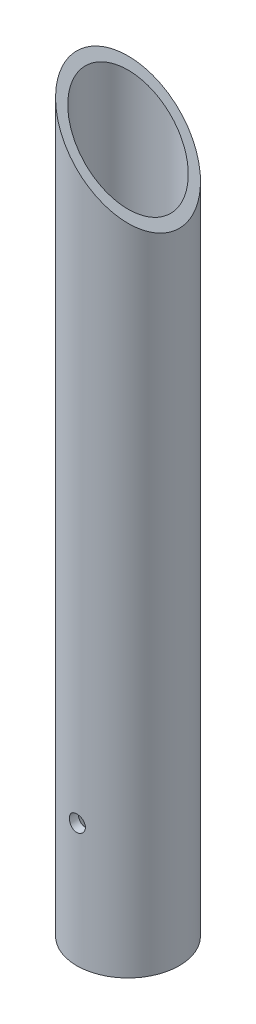
ISO-10303-21;
HEADER;
FILE_DESCRIPTION(('STEP AP214'),'2;1');
FILE_NAME('part.step','',(''),(''),'','','');
FILE_SCHEMA(('AUTOMOTIVE_DESIGN { 1 0 10303 214 1 1 1 1 }'));
ENDSEC;
DATA;
#1=APPLICATION_CONTEXT('core data for automotive mechanical design processes');
#2=APPLICATION_PROTOCOL_DEFINITION('international standard','automotive_design',2000,#1);
#3=PRODUCT_CONTEXT('',#1,'mechanical');
#4=PRODUCT('Part','Part','',(#3));
#5=PRODUCT_RELATED_PRODUCT_CATEGORY('part','',(#4));
#6=PRODUCT_DEFINITION_FORMATION('','',#4);
#7=PRODUCT_DEFINITION_CONTEXT('part definition',#1,'design');
#8=PRODUCT_DEFINITION('design','',#6,#7);
#9=PRODUCT_DEFINITION_SHAPE('','',#8);
#10=(LENGTH_UNIT() NAMED_UNIT(*) SI_UNIT(.MILLI.,.METRE.));
#11=(NAMED_UNIT(*) PLANE_ANGLE_UNIT() SI_UNIT($,.RADIAN.));
#12=(NAMED_UNIT(*) SI_UNIT($,.STERADIAN.) SOLID_ANGLE_UNIT());
#13=UNCERTAINTY_MEASURE_WITH_UNIT(LENGTH_MEASURE(1.E-05),#10,'distance_accuracy_value','');
#14=(GEOMETRIC_REPRESENTATION_CONTEXT(3) GLOBAL_UNCERTAINTY_ASSIGNED_CONTEXT((#13)) GLOBAL_UNIT_ASSIGNED_CONTEXT((#10,
#11,#12)) REPRESENTATION_CONTEXT('',''));
#15=CARTESIAN_POINT('',(0.,0.,0.));
#16=DIRECTION('',(0.,0.,1.));
#17=DIRECTION('',(1.,0.,0.));
#18=AXIS2_PLACEMENT_3D('',#15,#16,#17);
#19=CARTESIAN_POINT('',(0.,-101.6,25.2984));
#20=DIRECTION('',(0.,0.,-1.));
#21=DIRECTION('',(-1.,0.,0.));
#22=AXIS2_PLACEMENT_3D('',#19,#20,#21);
#23=CYLINDRICAL_SURFACE('',#22,3.302);
#24=CARTESIAN_POINT('',(3.302,-101.6,17.212131535635));
#25=CARTESIAN_POINT('',(3.30199130007002,-101.783512818645,17.2121357912959));
#26=CARTESIAN_POINT('',(3.28663585313906,-101.967256012137,17.2151010141485));
#27=CARTESIAN_POINT('',(3.22562147458273,-102.329703814538,17.2266354162427));
#28=CARTESIAN_POINT('',(3.17990188170017,-102.508397589212,17.235215812932));
#29=CARTESIAN_POINT('',(3.05960981849083,-102.8552358969,17.2569745758185));
#30=CARTESIAN_POINT('',(2.98507722350842,-103.023394637605,17.2701465850535));
#31=CARTESIAN_POINT('',(2.80936907233875,-103.344760680324,17.2995959096477));
#32=CARTESIAN_POINT('',(2.70820265297164,-103.497973085071,17.3158721595603));
#33=CARTESIAN_POINT('',(2.48072155818345,-103.78710779034,17.3499290051584));
#34=CARTESIAN_POINT('',(2.35413406488901,-103.9228137313,17.3677245991603));
#35=CARTESIAN_POINT('',(2.07998787720683,-104.171200837909,17.4026833164607));
#36=CARTESIAN_POINT('',(1.93242669927012,-104.283879272953,17.4198463645542));
#37=CARTESIAN_POINT('',(1.61912172583027,-104.483824177459,17.4517639888191));
#38=CARTESIAN_POINT('',(1.45324708551853,-104.570888997584,17.4664990714187));
#39=CARTESIAN_POINT('',(1.10890232271858,-104.715834785477,17.4917344998527));
#40=CARTESIAN_POINT('',(0.930433354973723,-104.773718424845,17.5022352333331));
#41=CARTESIAN_POINT('',(0.568185677153312,-104.857996883894,17.5177140797912));
#42=CARTESIAN_POINT('',(0.384493776564784,-104.884753008328,17.5227555116936));
#43=CARTESIAN_POINT('',(0.0151634313080578,-104.907142782504,17.5269660010195));
#44=CARTESIAN_POINT('',(-0.170474847849683,-104.902779057434,17.526135553779));
#45=CARTESIAN_POINT('',(-0.535948321762245,-104.863329959929,17.5187453165642));
#46=CARTESIAN_POINT('',(-0.715827218444372,-104.828633892647,17.5122581315663));
#47=CARTESIAN_POINT('',(-1.06716471944178,-104.730120368197,17.4943647240374));
#48=CARTESIAN_POINT('',(-1.23862294887289,-104.666301615798,17.4829582827243));
#49=CARTESIAN_POINT('',(-1.56938357210161,-104.510981755474,17.4563863678042));
#50=CARTESIAN_POINT('',(-1.72861081598389,-104.419324375918,17.4411997634979));
#51=CARTESIAN_POINT('',(-2.02955810161077,-104.211051521487,17.4087481619631));
#52=CARTESIAN_POINT('',(-2.1712776543047,-104.094435349673,17.3914831067029));
#53=CARTESIAN_POINT('',(-2.4354828311894,-103.837433376739,17.35647319222));
#54=CARTESIAN_POINT('',(-2.55764096472366,-103.696711167756,17.3387250336484));
#55=CARTESIAN_POINT('',(-2.77672597148959,-103.396532388428,17.3049934941075));
#56=CARTESIAN_POINT('',(-2.87364158354753,-103.237067502496,17.2890109026162));
#57=CARTESIAN_POINT('',(-3.03957910177399,-102.903449024681,17.2606131954961));
#58=CARTESIAN_POINT('',(-3.10853019051617,-102.729259474038,17.248207159813));
#59=CARTESIAN_POINT('',(-3.21595739527462,-102.371706911882,17.2285032482303));
#60=CARTESIAN_POINT('',(-3.25449780559778,-102.188364130084,17.2211945992488));
#61=CARTESIAN_POINT('',(-3.2855165099523,-101.93637451914,17.2152867144043));
#62=CARTESIAN_POINT('',(-3.29169262178811,-101.869262681312,17.2141062438161));
#63=CARTESIAN_POINT('',(-3.29993596755384,-101.734777589169,17.2125278723074));
#64=CARTESIAN_POINT('',(-3.30200319548789,-101.667404334473,17.2121299725289));
#65=CARTESIAN_POINT('',(-3.30199130007002,-101.416487181355,17.2121357912959));
#66=CARTESIAN_POINT('',(-3.28663585313906,-101.232743987863,17.2151010141485));
#67=CARTESIAN_POINT('',(-3.22562147458273,-100.870296185462,17.2266354162427));
#68=CARTESIAN_POINT('',(-3.17990188170017,-100.691602410788,17.235215812932));
#69=CARTESIAN_POINT('',(-3.05960981849083,-100.3447641031,17.2569745758185));
#70=CARTESIAN_POINT('',(-2.98507722350842,-100.176605362395,17.2701465850535));
#71=CARTESIAN_POINT('',(-2.80936907233875,-99.8552393196757,17.2995959096477));
#72=CARTESIAN_POINT('',(-2.70820265297164,-99.7020269149291,17.3158721595603));
#73=CARTESIAN_POINT('',(-2.48072155818345,-99.4128922096604,17.3499290051584));
#74=CARTESIAN_POINT('',(-2.35413406488901,-99.2771862687002,17.3677245991603));
#75=CARTESIAN_POINT('',(-2.07998787720683,-99.0287991620913,17.4026833164607));
#76=CARTESIAN_POINT('',(-1.93242669927012,-98.9161207270474,17.4198463645542));
#77=CARTESIAN_POINT('',(-1.61912172583027,-98.7161758225405,17.4517639888191));
#78=CARTESIAN_POINT('',(-1.45324708551853,-98.6291110024161,17.4664990714187));
#79=CARTESIAN_POINT('',(-1.10890232271858,-98.4841652145225,17.4917344998527));
#80=CARTESIAN_POINT('',(-0.930433354973721,-98.4262815751546,17.5022352333331));
#81=CARTESIAN_POINT('',(-0.568185677153313,-98.3420031161057,17.5177140797912));
#82=CARTESIAN_POINT('',(-0.384493776564784,-98.3152469916725,17.5227555116936));
#83=CARTESIAN_POINT('',(-0.0151634313080579,-98.2928572174964,17.5269660010195));
#84=CARTESIAN_POINT('',(0.170474847849683,-98.2972209425664,17.526135553779));
#85=CARTESIAN_POINT('',(0.535948321762243,-98.3366700400711,17.5187453165642));
#86=CARTESIAN_POINT('',(0.715827218444368,-98.3713661073525,17.5122581315663));
#87=CARTESIAN_POINT('',(1.06716471944178,-98.4698796318034,17.4943647240374));
#88=CARTESIAN_POINT('',(1.23862294887289,-98.5336983842019,17.4829582827243));
#89=CARTESIAN_POINT('',(1.56938357210161,-98.6890182445264,17.4563863678042));
#90=CARTESIAN_POINT('',(1.72861081598389,-98.7806756240815,17.4411997634979));
#91=CARTESIAN_POINT('',(2.02955810161077,-98.988948478513,17.4087481619631));
#92=CARTESIAN_POINT('',(2.1712776543047,-99.1055646503267,17.3914831067029));
#93=CARTESIAN_POINT('',(2.4354828311894,-99.3625666232612,17.35647319222));
#94=CARTESIAN_POINT('',(2.55764096472366,-99.5032888322443,17.3387250336484));
#95=CARTESIAN_POINT('',(2.77672597148959,-99.8034676115724,17.3049934941075));
#96=CARTESIAN_POINT('',(2.87364158354753,-99.9629324975044,17.2890109026162));
#97=CARTESIAN_POINT('',(3.03957910177399,-100.296550975319,17.2606131954961));
#98=CARTESIAN_POINT('',(3.10853019051618,-100.470740525962,17.248207159813));
#99=CARTESIAN_POINT('',(3.21595739527462,-100.828293088118,17.2285032482303));
#100=CARTESIAN_POINT('',(3.25449780559778,-101.011635869916,17.2211945992487));
#101=CARTESIAN_POINT('',(3.2855165099523,-101.26362548086,17.2152867144043));
#102=CARTESIAN_POINT('',(3.29169262178811,-101.330737318688,17.2141062438161));
#103=CARTESIAN_POINT('',(3.29993596755384,-101.465222410831,17.2125278723074));
#104=CARTESIAN_POINT('',(3.30200319548789,-101.532595665527,17.2121299725289));
#105=CARTESIAN_POINT('',(3.302,-101.6,17.212131535635));
#106=B_SPLINE_CURVE_WITH_KNOTS('',3,(#24,#25,#26,#27,#28,#29,#30,#31,#32,#33,#34,#35,#36,#37,
#38,#39,#40,#41,#42,#43,#44,#45,#46,#47,#48,#49,#50,#51,#52,#53,#54,#55,#56,#57,#58,#59,#60,#61,
#62,#63,#64,#65,#66,#67,#68,#69,#70,#71,#72,#73,#74,#75,#76,#77,#78,#79,#80,#81,#82,#83,#84,#85,
#86,#87,#88,#89,#90,#91,#92,#93,#94,#95,#96,#97,#98,#99,#100,#101,#102,#103,#104,#105),
.UNSPECIFIED.,.T.,.F.,(4,2,2,2,2,2,2,2,2,2,2,2,2,2,2,2,2,2,2,2,2,2,2,2,2,2,2,2,2,2,2,2,2,2,2,2,
2,2,2,2,4),(0.,0.550280728118776,1.1016641231347,1.65228715504278,2.20272153951086,
2.75941341573735,3.31617126630994,3.87720172279344,4.4381808064211,4.99258136898155,
5.5469351643474,6.0942767793971,6.64164273979224,7.19213997066774,7.74265257536888,
8.30158887354543,8.86077409849182,9.42136669374738,9.98077088361991,10.1828889285657,
10.3850072684503,10.9352879965691,11.486671391585,12.0372944234931,12.5877288079612,
13.1444206841877,13.7011785347603,14.2622089912438,14.8231880748714,15.3775886374319,
15.9319424327977,16.4792840478474,17.0266500082426,17.5771472391181,18.1276598438192,
18.6865961419958,19.2457813669421,19.8063739621977,20.3657781520702,20.567896197016,
20.7700145369006),.UNSPECIFIED.);
#107=CARTESIAN_POINT('',(3.302,-101.6,17.212131535635));
#108=VERTEX_POINT('',#107);
#109=EDGE_CURVE('E19',#108,#108,#106,.T.);
#110=ORIENTED_EDGE('',*,*,#109,.T.);
#111=EDGE_LOOP('',(#110));
#112=FACE_BOUND('',#111,.T.);
#113=CARTESIAN_POINT('',(-3.302,-101.6,20.8218039564299));
#114=CARTESIAN_POINT('',(-3.30199160753357,-101.415927011816,20.8218073806267));
#115=CARTESIAN_POINT('',(-3.28654301260894,-101.231617371956,20.8242733684239));
#116=CARTESIAN_POINT('',(-3.22514065789151,-100.868022619064,20.8338695525104));
#117=CARTESIAN_POINT('',(-3.17912451730725,-100.688748563809,20.8410092863234));
#118=CARTESIAN_POINT('',(-3.05799853788291,-100.340741796334,20.8591249107495));
#119=CARTESIAN_POINT('',(-2.9829239644666,-100.171996593407,20.870096149862));
#120=CARTESIAN_POINT('',(-2.80588978432558,-99.8495680404577,20.8946321673489));
#121=CARTESIAN_POINT('',(-2.7039404616579,-99.6958789597579,20.9081959530987));
#122=CARTESIAN_POINT('',(-2.47508070345098,-99.4064927241757,20.9365245741082));
#123=CARTESIAN_POINT('',(-2.34797939326253,-99.2709473361724,20.9512980530242));
#124=CARTESIAN_POINT('',(-2.07283012487502,-99.0230095326334,20.9803050551998));
#125=CARTESIAN_POINT('',(-1.92477991142582,-98.9106196130989,20.9945385201148));
#126=CARTESIAN_POINT('',(-1.6109795917043,-98.7116369694203,21.0209503025573));
#127=CARTESIAN_POINT('',(-1.44514095474079,-98.6251822552555,21.0331174809926));
#128=CARTESIAN_POINT('',(-1.10107506605374,-98.4814114743445,21.05393135813));
#129=CARTESIAN_POINT('',(-0.922848635277752,-98.4240934787771,21.0625782898611));
#130=CARTESIAN_POINT('',(-0.560609603386695,-98.3406777001467,21.0753173636847));
#131=CARTESIAN_POINT('',(-0.376656148144354,-98.3143287558805,21.0794461292818));
#132=CARTESIAN_POINT('',(-0.00689553053005387,-98.2928187423374,21.0828093145542));
#133=CARTESIAN_POINT('',(0.178911522424525,-98.2976558429065,21.0820440214374));
#134=CARTESIAN_POINT('',(0.545387987681637,-98.3381832224789,21.07573448412));
#135=CARTESIAN_POINT('',(0.726088139323015,-98.3736029879841,21.0702321418829));
#136=CARTESIAN_POINT('',(1.07894959112666,-98.4738656431935,21.0551133735714));
#137=CARTESIAN_POINT('',(1.25111058419742,-98.5387095902219,21.0454967996575));
#138=CARTESIAN_POINT('',(1.58282366581658,-98.6962561888344,21.0231579611584));
#139=CARTESIAN_POINT('',(1.74232079287567,-98.7890726938112,21.0104230448454));
#140=CARTESIAN_POINT('',(2.04356567709641,-98.9998387247241,20.983266477008));
#141=CARTESIAN_POINT('',(2.18531354855578,-99.1177880888019,20.9688448363465));
#142=CARTESIAN_POINT('',(2.44862169860154,-99.3769527385603,20.9397407137842));
#143=CARTESIAN_POINT('',(2.56995357233259,-99.5184000368347,20.925057084518));
#144=CARTESIAN_POINT('',(2.78725086621637,-99.8198417364553,20.8972247356282));
#145=CARTESIAN_POINT('',(2.8832048216977,-99.9798444735734,20.8840767112186));
#146=CARTESIAN_POINT('',(3.04705056434819,-100.314146711663,20.8608028211873));
#147=CARTESIAN_POINT('',(3.11489418988142,-100.48847014126,20.8506821505325));
#148=CARTESIAN_POINT('',(3.22013679209878,-100.846000745735,20.8346903229562));
#149=CARTESIAN_POINT('',(3.25760012468806,-101.029188265883,20.828810186069));
#150=CARTESIAN_POINT('',(3.28690487349376,-101.278069948559,20.8241928990953));
#151=CARTESIAN_POINT('',(3.29256105712587,-101.342314281715,20.8232989883506));
#152=CARTESIAN_POINT('',(3.30011009230049,-101.471029390881,20.8221039168489));
#153=CARTESIAN_POINT('',(3.30200294075023,-101.535500167079,20.8218027565791));
#154=CARTESIAN_POINT('',(3.30199160753357,-101.784072988184,20.8218073806267));
#155=CARTESIAN_POINT('',(3.28654301260894,-101.968382628044,20.8242733684239));
#156=CARTESIAN_POINT('',(3.22514065789151,-102.331977380936,20.8338695525104));
#157=CARTESIAN_POINT('',(3.17912451730725,-102.511251436191,20.8410092863234));
#158=CARTESIAN_POINT('',(3.05799853788291,-102.859258203666,20.8591249107495));
#159=CARTESIAN_POINT('',(2.9829239644666,-103.028003406593,20.870096149862));
#160=CARTESIAN_POINT('',(2.80588978432558,-103.350431959542,20.8946321673489));
#161=CARTESIAN_POINT('',(2.7039404616579,-103.504121040242,20.9081959530987));
#162=CARTESIAN_POINT('',(2.47508070345098,-103.793507275824,20.9365245741082));
#163=CARTESIAN_POINT('',(2.34797939326253,-103.929052663828,20.9512980530242));
#164=CARTESIAN_POINT('',(2.07283012487502,-104.176990467367,20.9803050551998));
#165=CARTESIAN_POINT('',(1.92477991142582,-104.289380386901,20.9945385201148));
#166=CARTESIAN_POINT('',(1.6109795917043,-104.48836303058,21.0209503025573));
#167=CARTESIAN_POINT('',(1.44514095474079,-104.574817744745,21.0331174809926));
#168=CARTESIAN_POINT('',(1.10107506605374,-104.718588525656,21.05393135813));
#169=CARTESIAN_POINT('',(0.922848635277752,-104.775906521223,21.0625782898611));
#170=CARTESIAN_POINT('',(0.560609603386695,-104.859322299853,21.0753173636847));
#171=CARTESIAN_POINT('',(0.376656148144354,-104.885671244119,21.0794461292818));
#172=CARTESIAN_POINT('',(0.00689553053005382,-104.907181257663,21.0828093145542));
#173=CARTESIAN_POINT('',(-0.178911522424526,-104.902344157093,21.0820440214374));
#174=CARTESIAN_POINT('',(-0.545387987681637,-104.861816777521,21.07573448412));
#175=CARTESIAN_POINT('',(-0.726088139323015,-104.826397012016,21.0702321418829));
#176=CARTESIAN_POINT('',(-1.07894959112666,-104.726134356806,21.0551133735714));
#177=CARTESIAN_POINT('',(-1.25111058419742,-104.661290409778,21.0454967996575));
#178=CARTESIAN_POINT('',(-1.58282366581658,-104.503743811166,21.0231579611584));
#179=CARTESIAN_POINT('',(-1.74232079287567,-104.410927306189,21.0104230448454));
#180=CARTESIAN_POINT('',(-2.04356567709641,-104.200161275276,20.983266477008));
#181=CARTESIAN_POINT('',(-2.18531354855578,-104.082211911198,20.9688448363465));
#182=CARTESIAN_POINT('',(-2.44862169860154,-103.82304726144,20.9397407137842));
#183=CARTESIAN_POINT('',(-2.56995357233259,-103.681599963165,20.925057084518));
#184=CARTESIAN_POINT('',(-2.78725086621637,-103.380158263545,20.8972247356282));
#185=CARTESIAN_POINT('',(-2.88320482169769,-103.220155526427,20.8840767112186));
#186=CARTESIAN_POINT('',(-3.04705056434819,-102.885853288337,20.8608028211873));
#187=CARTESIAN_POINT('',(-3.11489418988142,-102.71152985874,20.8506821505325));
#188=CARTESIAN_POINT('',(-3.22013679209878,-102.353999254265,20.8346903229562));
#189=CARTESIAN_POINT('',(-3.25760012468806,-102.170811734116,20.828810186069));
#190=CARTESIAN_POINT('',(-3.28690487349376,-101.921930051441,20.8241928990953));
#191=CARTESIAN_POINT('',(-3.29256105712587,-101.857685718285,20.8232989883506));
#192=CARTESIAN_POINT('',(-3.30011009230049,-101.728970609118,20.822103916849));
#193=CARTESIAN_POINT('',(-3.30200294075023,-101.664499832921,20.8218027565791));
#194=CARTESIAN_POINT('',(-3.302,-101.6,20.8218039564299));
#195=B_SPLINE_CURVE_WITH_KNOTS('',3,(#113,#114,#115,#116,#117,#118,#119,#120,#121,#122,#123,
#124,#125,#126,#127,#128,#129,#130,#131,#132,#133,#134,#135,#136,#137,#138,#139,#140,#141,#142,
#143,#144,#145,#146,#147,#148,#149,#150,#151,#152,#153,#154,#155,#156,#157,#158,#159,#160,#161,
#162,#163,#164,#165,#166,#167,#168,#169,#170,#171,#172,#173,#174,#175,#176,#177,#178,#179,#180,
#181,#182,#183,#184,#185,#186,#187,#188,#189,#190,#191,#192,#193,#194),.UNSPECIFIED.,.T.,.F.,(4,
2,2,2,2,2,2,2,2,2,2,2,2,2,2,2,2,2,2,2,2,2,2,2,2,2,2,2,2,2,2,2,2,2,2,2,2,2,2,2,4),(0.,
0.55197278689678,1.10507548841285,1.65750903647682,2.20973149302041,2.76631755972952,
3.32296359125632,3.88252122115703,4.44204180408307,4.99699261923523,5.5519108673788,
6.10197039090308,6.652049681752,7.20439884684058,7.75674445485043,8.31490894049801,
8.87332515223377,9.43269418546172,9.99087516451011,10.1842882427925,10.3777014800249,
10.9296742669216,11.4827769684377,12.0352105165017,12.5874329730453,13.1440190397544,
13.7006650712812,14.2602227011819,14.8197432841079,15.3746940992601,15.9296123474037,
16.4796718709279,17.0297511617769,17.5821003268654,18.1344459348753,18.6926104205229,
19.2510266322586,19.8103956654866,20.368576644535,20.5619897228173,20.7554029600497),.UNSPECIFIED.);
#196=CARTESIAN_POINT('',(-3.302,-101.6,20.8218039564299));
#197=VERTEX_POINT('',#196);
#198=EDGE_CURVE('E46',#197,#197,#195,.T.);
#199=ORIENTED_EDGE('',*,*,#198,.F.);
#200=EDGE_LOOP('',(#199));
#201=FACE_BOUND('',#200,.T.);
#202=ADVANCED_FACE('F15',(#112,#201),#23,.F.);
#203=CARTESIAN_POINT('',(0.,-152.4,0.));
#204=DIRECTION('',(0.,1.,0.));
#205=DIRECTION('',(0.,0.,1.));
#206=AXIS2_PLACEMENT_3D('',#203,#204,#205);
#207=CYLINDRICAL_SURFACE('',#206,17.526);
#208=CARTESIAN_POINT('',(0.,-152.4,0.));
#209=DIRECTION('',(0.,1.,0.));
#210=DIRECTION('',(0.,0.,1.));
#211=AXIS2_PLACEMENT_3D('',#208,#209,#210);
#212=CIRCLE('',#211,17.526);
#213=CARTESIAN_POINT('',(0.,-152.4,17.526));
#214=VERTEX_POINT('',#213);
#215=EDGE_CURVE('E52',#214,#214,#212,.F.);
#216=ORIENTED_EDGE('',*,*,#215,.T.);
#217=EDGE_LOOP('',(#216));
#218=FACE_BOUND('',#217,.T.);
#219=CARTESIAN_POINT('',(-3.302,-101.6,-17.212131535635));
#220=CARTESIAN_POINT('',(-3.30199130007002,-101.416487181355,-17.2121357912959));
#221=CARTESIAN_POINT('',(-3.28663585313906,-101.232743987863,-17.2151010141485));
#222=CARTESIAN_POINT('',(-3.22562147458273,-100.870296185462,-17.2266354162427));
#223=CARTESIAN_POINT('',(-3.17990188170017,-100.691602410788,-17.235215812932));
#224=CARTESIAN_POINT('',(-3.05960981849083,-100.3447641031,-17.2569745758185));
#225=CARTESIAN_POINT('',(-2.98507722350842,-100.176605362395,-17.2701465850535));
#226=CARTESIAN_POINT('',(-2.80936907233875,-99.8552393196757,-17.2995959096477));
#227=CARTESIAN_POINT('',(-2.70820265297164,-99.7020269149291,-17.3158721595603));
#228=CARTESIAN_POINT('',(-2.48072155818345,-99.4128922096604,-17.3499290051584));
#229=CARTESIAN_POINT('',(-2.35413406488901,-99.2771862687002,-17.3677245991603));
#230=CARTESIAN_POINT('',(-2.07998787720683,-99.0287991620913,-17.4026833164607));
#231=CARTESIAN_POINT('',(-1.93242669927012,-98.9161207270474,-17.4198463645542));
#232=CARTESIAN_POINT('',(-1.61912172583027,-98.7161758225405,-17.4517639888191));
#233=CARTESIAN_POINT('',(-1.45324708551853,-98.6291110024161,-17.4664990714187));
#234=CARTESIAN_POINT('',(-1.10890232271858,-98.4841652145225,-17.4917344998527));
#235=CARTESIAN_POINT('',(-0.930433354973723,-98.4262815751546,-17.5022352333331));
#236=CARTESIAN_POINT('',(-0.568185677153312,-98.3420031161057,-17.5177140797912));
#237=CARTESIAN_POINT('',(-0.384493776564784,-98.3152469916725,-17.5227555116936));
#238=CARTESIAN_POINT('',(-0.0151634313080578,-98.2928572174964,-17.5269660010195));
#239=CARTESIAN_POINT('',(0.170474847849683,-98.2972209425664,-17.526135553779));
#240=CARTESIAN_POINT('',(0.535948321762245,-98.3366700400711,-17.5187453165642));
#241=CARTESIAN_POINT('',(0.715827218444372,-98.3713661073525,-17.5122581315663));
#242=CARTESIAN_POINT('',(1.06716471944178,-98.4698796318034,-17.4943647240374));
#243=CARTESIAN_POINT('',(1.23862294887289,-98.5336983842019,-17.4829582827243));
#244=CARTESIAN_POINT('',(1.56938357210161,-98.6890182445264,-17.4563863678042));
#245=CARTESIAN_POINT('',(1.72861081598389,-98.7806756240815,-17.4411997634979));
#246=CARTESIAN_POINT('',(2.02955810161077,-98.988948478513,-17.4087481619631));
#247=CARTESIAN_POINT('',(2.1712776543047,-99.1055646503267,-17.3914831067029));
#248=CARTESIAN_POINT('',(2.4354828311894,-99.3625666232612,-17.35647319222));
#249=CARTESIAN_POINT('',(2.55764096472366,-99.5032888322443,-17.3387250336484));
#250=CARTESIAN_POINT('',(2.77672597148959,-99.8034676115724,-17.3049934941075));
#251=CARTESIAN_POINT('',(2.87364158354753,-99.9629324975044,-17.2890109026162));
#252=CARTESIAN_POINT('',(3.03957910177399,-100.296550975319,-17.2606131954961));
#253=CARTESIAN_POINT('',(3.10853019051618,-100.470740525962,-17.248207159813));
#254=CARTESIAN_POINT('',(3.21595739527462,-100.828293088118,-17.2285032482303));
#255=CARTESIAN_POINT('',(3.25449780559778,-101.011635869916,-17.2211945992487));
#256=CARTESIAN_POINT('',(3.2855165099523,-101.26362548086,-17.2152867144043));
#257=CARTESIAN_POINT('',(3.29169262178811,-101.330737318688,-17.2141062438161));
#258=CARTESIAN_POINT('',(3.29993596755384,-101.465222410831,-17.2125278723074));
#259=CARTESIAN_POINT('',(3.30200319548789,-101.532595665527,-17.2121299725289));
#260=CARTESIAN_POINT('',(3.30199130007002,-101.783512818645,-17.2121357912959));
#261=CARTESIAN_POINT('',(3.28663585313906,-101.967256012137,-17.2151010141485));
#262=CARTESIAN_POINT('',(3.22562147458273,-102.329703814538,-17.2266354162427));
#263=CARTESIAN_POINT('',(3.17990188170017,-102.508397589212,-17.235215812932));
#264=CARTESIAN_POINT('',(3.05960981849083,-102.8552358969,-17.2569745758185));
#265=CARTESIAN_POINT('',(2.98507722350842,-103.023394637605,-17.2701465850535));
#266=CARTESIAN_POINT('',(2.80936907233875,-103.344760680324,-17.2995959096476));
#267=CARTESIAN_POINT('',(2.70820265297164,-103.497973085071,-17.3158721595603));
#268=CARTESIAN_POINT('',(2.48072155818345,-103.78710779034,-17.3499290051584));
#269=CARTESIAN_POINT('',(2.35413406488901,-103.9228137313,-17.3677245991603));
#270=CARTESIAN_POINT('',(2.07998787720683,-104.171200837909,-17.4026833164607));
#271=CARTESIAN_POINT('',(1.93242669927012,-104.283879272953,-17.4198463645542));
#272=CARTESIAN_POINT('',(1.61912172583027,-104.483824177459,-17.4517639888191));
#273=CARTESIAN_POINT('',(1.45324708551853,-104.570888997584,-17.4664990714187));
#274=CARTESIAN_POINT('',(1.10890232271858,-104.715834785477,-17.4917344998527));
#275=CARTESIAN_POINT('',(0.930433354973723,-104.773718424845,-17.5022352333331));
#276=CARTESIAN_POINT('',(0.568185677153312,-104.857996883894,-17.5177140797912));
#277=CARTESIAN_POINT('',(0.384493776564784,-104.884753008328,-17.5227555116936));
#278=CARTESIAN_POINT('',(0.015163431308058,-104.907142782504,-17.5269660010195));
#279=CARTESIAN_POINT('',(-0.170474847849683,-104.902779057434,-17.526135553779));
#280=CARTESIAN_POINT('',(-0.535948321762246,-104.863329959929,-17.5187453165642));
#281=CARTESIAN_POINT('',(-0.715827218444373,-104.828633892647,-17.5122581315663));
#282=CARTESIAN_POINT('',(-1.06716471944178,-104.730120368197,-17.4943647240374));
#283=CARTESIAN_POINT('',(-1.23862294887289,-104.666301615798,-17.4829582827243));
#284=CARTESIAN_POINT('',(-1.56938357210161,-104.510981755474,-17.4563863678042));
#285=CARTESIAN_POINT('',(-1.72861081598389,-104.419324375918,-17.4411997634979));
#286=CARTESIAN_POINT('',(-2.02955810161077,-104.211051521487,-17.4087481619631));
#287=CARTESIAN_POINT('',(-2.1712776543047,-104.094435349673,-17.3914831067029));
#288=CARTESIAN_POINT('',(-2.4354828311894,-103.837433376739,-17.35647319222));
#289=CARTESIAN_POINT('',(-2.55764096472366,-103.696711167756,-17.3387250336484));
#290=CARTESIAN_POINT('',(-2.77672597148959,-103.396532388428,-17.3049934941075));
#291=CARTESIAN_POINT('',(-2.87364158354753,-103.237067502496,-17.2890109026162));
#292=CARTESIAN_POINT('',(-3.03957910177399,-102.903449024681,-17.2606131954961));
#293=CARTESIAN_POINT('',(-3.10853019051617,-102.729259474038,-17.248207159813));
#294=CARTESIAN_POINT('',(-3.21595739527462,-102.371706911882,-17.2285032482303));
#295=CARTESIAN_POINT('',(-3.25449780559778,-102.188364130084,-17.2211945992487));
#296=CARTESIAN_POINT('',(-3.2855165099523,-101.93637451914,-17.2152867144043));
#297=CARTESIAN_POINT('',(-3.29169262178811,-101.869262681312,-17.2141062438161));
#298=CARTESIAN_POINT('',(-3.29993596755384,-101.734777589169,-17.2125278723074));
#299=CARTESIAN_POINT('',(-3.30200319548789,-101.667404334473,-17.2121299725289));
#300=CARTESIAN_POINT('',(-3.302,-101.6,-17.212131535635));
#301=B_SPLINE_CURVE_WITH_KNOTS('',3,(#219,#220,#221,#222,#223,#224,#225,#226,#227,#228,#229,
#230,#231,#232,#233,#234,#235,#236,#237,#238,#239,#240,#241,#242,#243,#244,#245,#246,#247,#248,
#249,#250,#251,#252,#253,#254,#255,#256,#257,#258,#259,#260,#261,#262,#263,#264,#265,#266,#267,
#268,#269,#270,#271,#272,#273,#274,#275,#276,#277,#278,#279,#280,#281,#282,#283,#284,#285,#286,
#287,#288,#289,#290,#291,#292,#293,#294,#295,#296,#297,#298,#299,#300),.UNSPECIFIED.,.T.,.F.,(4,
2,2,2,2,2,2,2,2,2,2,2,2,2,2,2,2,2,2,2,2,2,2,2,2,2,2,2,2,2,2,2,2,2,2,2,2,2,2,2,4),(0.,
0.550280728118776,1.1016641231347,1.65228715504278,2.20272153951086,2.75941341573735,
3.31617126630994,3.87720172279344,4.4381808064211,4.99258136898155,5.5469351643474,
6.0942767793971,6.64164273979224,7.19213997066774,7.74265257536888,8.30158887354543,
8.86077409849182,9.42136669374739,9.98077088361991,10.1828889285657,10.3850072684503,
10.9352879965691,11.486671391585,12.0372944234931,12.5877288079612,13.1444206841877,
13.7011785347603,14.2622089912438,14.8231880748714,15.3775886374319,15.9319424327977,
16.4792840478474,17.0266500082426,17.5771472391181,18.1276598438192,18.6865961419958,
19.2457813669421,19.8063739621977,20.3657781520702,20.567896197016,20.7700145369006),.UNSPECIFIED.);
#302=CARTESIAN_POINT('',(-3.302,-101.6,-17.212131535635));
#303=VERTEX_POINT('',#302);
#304=EDGE_CURVE('E76',#303,#303,#301,.T.);
#305=ORIENTED_EDGE('',*,*,#304,.T.);
#306=EDGE_LOOP('',(#305));
#307=FACE_BOUND('',#306,.T.);
#308=CARTESIAN_POINT('',(0.,131.318,0.));
#309=DIRECTION('',(-0.707106781186548,-0.707106781186548,0.));
#310=DIRECTION('',(-0.707106781186548,0.707106781186548,0.));
#311=AXIS2_PLACEMENT_3D('',#308,#309,#310);
#312=ELLIPSE('',#311,24.7855068941509,17.526);
#313=CARTESIAN_POINT('',(-17.526,148.844,0.));
#314=VERTEX_POINT('',#313);
#315=EDGE_CURVE('E51',#314,#314,#312,.F.);
#316=ORIENTED_EDGE('',*,*,#315,.T.);
#317=EDGE_LOOP('',(#316));
#318=FACE_BOUND('',#317,.T.);
#319=ORIENTED_EDGE('',*,*,#109,.F.);
#320=EDGE_LOOP('',(#319));
#321=FACE_BOUND('',#320,.T.);
#322=ADVANCED_FACE('F62',(#218,#307,#318,#321),#207,.F.);
#323=CARTESIAN_POINT('',(0.,-152.4,0.));
#324=DIRECTION('',(0.,1.,0.));
#325=DIRECTION('',(0.,0.,1.));
#326=AXIS2_PLACEMENT_3D('',#323,#324,#325);
#327=PLANE('',#326);
#328=ORIENTED_EDGE('',*,*,#215,.F.);
#329=EDGE_LOOP('',(#328));
#330=FACE_BOUND('',#329,.T.);
#331=CARTESIAN_POINT('',(0.,-152.4,0.));
#332=DIRECTION('',(0.,1.,0.));
#333=DIRECTION('',(0.,0.,1.));
#334=AXIS2_PLACEMENT_3D('',#331,#332,#333);
#335=CIRCLE('',#334,21.082);
#336=CARTESIAN_POINT('',(0.,-152.4,21.082));
#337=VERTEX_POINT('',#336);
#338=EDGE_CURVE('E30',#337,#337,#335,.T.);
#339=ORIENTED_EDGE('',*,*,#338,.F.);
#340=EDGE_LOOP('',(#339));
#341=FACE_BOUND('',#340,.T.);
#342=ADVANCED_FACE('F64',(#330,#341),#327,.F.);
#343=CARTESIAN_POINT('',(-21.082,152.4,-25.2984));
#344=DIRECTION('',(-0.707106781186548,-0.707106781186548,0.));
#345=DIRECTION('',(0.707106781186548,-0.707106781186548,0.));
#346=AXIS2_PLACEMENT_3D('',#343,#344,#345);
#347=PLANE('',#346);
#348=ORIENTED_EDGE('',*,*,#315,.F.);
#349=EDGE_LOOP('',(#348));
#350=FACE_BOUND('',#349,.T.);
#351=CARTESIAN_POINT('',(0.,131.318,0.));
#352=DIRECTION('',(-0.707106781186548,-0.707106781186548,0.));
#353=DIRECTION('',(-0.707106781186548,0.707106781186548,0.));
#354=AXIS2_PLACEMENT_3D('',#351,#352,#353);
#355=ELLIPSE('',#354,29.8144503219496,21.082);
#356=CARTESIAN_POINT('',(-21.082,152.4,0.));
#357=VERTEX_POINT('',#356);
#358=EDGE_CURVE('E25',#357,#357,#355,.T.);
#359=ORIENTED_EDGE('',*,*,#358,.F.);
#360=EDGE_LOOP('',(#359));
#361=FACE_BOUND('',#360,.T.);
#362=ADVANCED_FACE('F70',(#350,#361),#347,.F.);
#363=CARTESIAN_POINT('',(0.,-101.6,25.2984));
#364=DIRECTION('',(0.,0.,-1.));
#365=DIRECTION('',(-1.,0.,0.));
#366=AXIS2_PLACEMENT_3D('',#363,#364,#365);
#367=CYLINDRICAL_SURFACE('',#366,3.302);
#368=ORIENTED_EDGE('',*,*,#304,.F.);
#369=EDGE_LOOP('',(#368));
#370=FACE_BOUND('',#369,.T.);
#371=CARTESIAN_POINT('',(-3.302,-101.6,-20.8218039564299));
#372=CARTESIAN_POINT('',(-3.30199160753357,-101.784072988184,-20.8218073806267));
#373=CARTESIAN_POINT('',(-3.28654301260894,-101.968382628044,-20.8242733684239));
#374=CARTESIAN_POINT('',(-3.22514065789151,-102.331977380936,-20.8338695525104));
#375=CARTESIAN_POINT('',(-3.17912451730725,-102.511251436191,-20.8410092863234));
#376=CARTESIAN_POINT('',(-3.05799853788291,-102.859258203666,-20.8591249107495));
#377=CARTESIAN_POINT('',(-2.9829239644666,-103.028003406593,-20.870096149862));
#378=CARTESIAN_POINT('',(-2.80588978432558,-103.350431959542,-20.8946321673489));
#379=CARTESIAN_POINT('',(-2.7039404616579,-103.504121040242,-20.9081959530987));
#380=CARTESIAN_POINT('',(-2.47508070345098,-103.793507275824,-20.9365245741082));
#381=CARTESIAN_POINT('',(-2.34797939326253,-103.929052663828,-20.9512980530242));
#382=CARTESIAN_POINT('',(-2.07283012487502,-104.176990467367,-20.9803050551998));
#383=CARTESIAN_POINT('',(-1.92477991142582,-104.289380386901,-20.9945385201148));
#384=CARTESIAN_POINT('',(-1.6109795917043,-104.48836303058,-21.0209503025573));
#385=CARTESIAN_POINT('',(-1.44514095474079,-104.574817744745,-21.0331174809926));
#386=CARTESIAN_POINT('',(-1.10107506605374,-104.718588525656,-21.05393135813));
#387=CARTESIAN_POINT('',(-0.922848635277752,-104.775906521223,-21.0625782898611));
#388=CARTESIAN_POINT('',(-0.560609603386695,-104.859322299853,-21.0753173636847));
#389=CARTESIAN_POINT('',(-0.376656148144354,-104.885671244119,-21.0794461292818));
#390=CARTESIAN_POINT('',(-0.00689553053005387,-104.907181257663,-21.0828093145542));
#391=CARTESIAN_POINT('',(0.178911522424525,-104.902344157093,-21.0820440214374));
#392=CARTESIAN_POINT('',(0.545387987681637,-104.861816777521,-21.07573448412));
#393=CARTESIAN_POINT('',(0.726088139323015,-104.826397012016,-21.0702321418829));
#394=CARTESIAN_POINT('',(1.07894959112666,-104.726134356806,-21.0551133735714));
#395=CARTESIAN_POINT('',(1.25111058419742,-104.661290409778,-21.0454967996575));
#396=CARTESIAN_POINT('',(1.58282366581658,-104.503743811166,-21.0231579611584));
#397=CARTESIAN_POINT('',(1.74232079287567,-104.410927306189,-21.0104230448454));
#398=CARTESIAN_POINT('',(2.04356567709641,-104.200161275276,-20.983266477008));
#399=CARTESIAN_POINT('',(2.18531354855578,-104.082211911198,-20.9688448363465));
#400=CARTESIAN_POINT('',(2.44862169860154,-103.82304726144,-20.9397407137842));
#401=CARTESIAN_POINT('',(2.56995357233259,-103.681599963165,-20.925057084518));
#402=CARTESIAN_POINT('',(2.78725086621637,-103.380158263545,-20.8972247356282));
#403=CARTESIAN_POINT('',(2.8832048216977,-103.220155526427,-20.8840767112186));
#404=CARTESIAN_POINT('',(3.04705056434819,-102.885853288337,-20.8608028211873));
#405=CARTESIAN_POINT('',(3.11489418988142,-102.71152985874,-20.8506821505325));
#406=CARTESIAN_POINT('',(3.22013679209878,-102.353999254265,-20.8346903229562));
#407=CARTESIAN_POINT('',(3.25760012468806,-102.170811734116,-20.828810186069));
#408=CARTESIAN_POINT('',(3.28690487349376,-101.921930051441,-20.8241928990953));
#409=CARTESIAN_POINT('',(3.29256105712587,-101.857685718285,-20.8232989883506));
#410=CARTESIAN_POINT('',(3.30011009230049,-101.728970609118,-20.8221039168489));
#411=CARTESIAN_POINT('',(3.30200294075023,-101.664499832921,-20.8218027565791));
#412=CARTESIAN_POINT('',(3.30199160753357,-101.415927011816,-20.8218073806267));
#413=CARTESIAN_POINT('',(3.28654301260894,-101.231617371956,-20.8242733684239));
#414=CARTESIAN_POINT('',(3.22514065789151,-100.868022619064,-20.8338695525104));
#415=CARTESIAN_POINT('',(3.17912451730725,-100.688748563809,-20.8410092863234));
#416=CARTESIAN_POINT('',(3.05799853788291,-100.340741796334,-20.8591249107495));
#417=CARTESIAN_POINT('',(2.9829239644666,-100.171996593407,-20.870096149862));
#418=CARTESIAN_POINT('',(2.80588978432558,-99.8495680404577,-20.8946321673489));
#419=CARTESIAN_POINT('',(2.7039404616579,-99.6958789597579,-20.9081959530987));
#420=CARTESIAN_POINT('',(2.47508070345098,-99.4064927241757,-20.9365245741082));
#421=CARTESIAN_POINT('',(2.34797939326253,-99.2709473361724,-20.9512980530242));
#422=CARTESIAN_POINT('',(2.07283012487502,-99.0230095326334,-20.9803050551998));
#423=CARTESIAN_POINT('',(1.92477991142582,-98.9106196130989,-20.9945385201148));
#424=CARTESIAN_POINT('',(1.6109795917043,-98.7116369694203,-21.0209503025573));
#425=CARTESIAN_POINT('',(1.44514095474079,-98.6251822552555,-21.0331174809926));
#426=CARTESIAN_POINT('',(1.10107506605374,-98.4814114743445,-21.05393135813));
#427=CARTESIAN_POINT('',(0.922848635277752,-98.4240934787771,-21.0625782898611));
#428=CARTESIAN_POINT('',(0.560609603386695,-98.3406777001467,-21.0753173636847));
#429=CARTESIAN_POINT('',(0.376656148144354,-98.3143287558805,-21.0794461292818));
#430=CARTESIAN_POINT('',(0.00689553053005384,-98.2928187423374,-21.0828093145542));
#431=CARTESIAN_POINT('',(-0.178911522424525,-98.2976558429065,-21.0820440214374));
#432=CARTESIAN_POINT('',(-0.545387987681638,-98.3381832224789,-21.07573448412));
#433=CARTESIAN_POINT('',(-0.726088139323017,-98.3736029879841,-21.0702321418829));
#434=CARTESIAN_POINT('',(-1.07894959112667,-98.4738656431935,-21.0551133735714));
#435=CARTESIAN_POINT('',(-1.25111058419742,-98.5387095902219,-21.0454967996575));
#436=CARTESIAN_POINT('',(-1.58282366581658,-98.6962561888344,-21.0231579611584));
#437=CARTESIAN_POINT('',(-1.74232079287567,-98.7890726938112,-21.0104230448454));
#438=CARTESIAN_POINT('',(-2.04356567709641,-98.9998387247241,-20.983266477008));
#439=CARTESIAN_POINT('',(-2.18531354855578,-99.1177880888019,-20.9688448363465));
#440=CARTESIAN_POINT('',(-2.44862169860154,-99.3769527385603,-20.9397407137842));
#441=CARTESIAN_POINT('',(-2.5699535723326,-99.5184000368347,-20.925057084518));
#442=CARTESIAN_POINT('',(-2.78725086621637,-99.8198417364553,-20.8972247356282));
#443=CARTESIAN_POINT('',(-2.8832048216977,-99.9798444735734,-20.8840767112186));
#444=CARTESIAN_POINT('',(-3.04705056434819,-100.314146711663,-20.8608028211873));
#445=CARTESIAN_POINT('',(-3.11489418988142,-100.48847014126,-20.8506821505325));
#446=CARTESIAN_POINT('',(-3.22013679209878,-100.846000745735,-20.8346903229562));
#447=CARTESIAN_POINT('',(-3.25760012468806,-101.029188265883,-20.828810186069));
#448=CARTESIAN_POINT('',(-3.28690487349376,-101.278069948559,-20.8241928990953));
#449=CARTESIAN_POINT('',(-3.29256105712587,-101.342314281715,-20.8232989883506));
#450=CARTESIAN_POINT('',(-3.30011009230049,-101.471029390881,-20.822103916849));
#451=CARTESIAN_POINT('',(-3.30200294075023,-101.535500167079,-20.8218027565791));
#452=CARTESIAN_POINT('',(-3.302,-101.6,-20.8218039564299));
#453=B_SPLINE_CURVE_WITH_KNOTS('',3,(#371,#372,#373,#374,#375,#376,#377,#378,#379,#380,#381,
#382,#383,#384,#385,#386,#387,#388,#389,#390,#391,#392,#393,#394,#395,#396,#397,#398,#399,#400,
#401,#402,#403,#404,#405,#406,#407,#408,#409,#410,#411,#412,#413,#414,#415,#416,#417,#418,#419,
#420,#421,#422,#423,#424,#425,#426,#427,#428,#429,#430,#431,#432,#433,#434,#435,#436,#437,#438,
#439,#440,#441,#442,#443,#444,#445,#446,#447,#448,#449,#450,#451,#452),.UNSPECIFIED.,.T.,.F.,(4,
2,2,2,2,2,2,2,2,2,2,2,2,2,2,2,2,2,2,2,2,2,2,2,2,2,2,2,2,2,2,2,2,2,2,2,2,2,2,2,4),(0.,
0.55197278689678,1.10507548841285,1.65750903647682,2.20973149302041,2.76631755972952,
3.32296359125632,3.88252122115703,4.44204180408307,4.99699261923523,5.5519108673788,
6.10197039090308,6.652049681752,7.20439884684058,7.75674445485043,8.31490894049801,
8.87332515223377,9.43269418546172,9.99087516451011,10.1842882427925,10.3777014800249,
10.9296742669216,11.4827769684377,12.0352105165017,12.5874329730453,13.1440190397544,
13.7006650712812,14.2602227011819,14.8197432841079,15.3746940992601,15.9296123474037,
16.4796718709279,17.0297511617769,17.5821003268654,18.1344459348753,18.6926104205229,
19.2510266322586,19.8103956654866,20.368576644535,20.5619897228173,20.7554029600497),.UNSPECIFIED.);
#454=CARTESIAN_POINT('',(-3.302,-101.6,-20.8218039564299));
#455=VERTEX_POINT('',#454);
#456=EDGE_CURVE('E10',#455,#455,#453,.T.);
#457=ORIENTED_EDGE('',*,*,#456,.F.);
#458=EDGE_LOOP('',(#457));
#459=FACE_BOUND('',#458,.T.);
#460=ADVANCED_FACE('F37',(#370,#459),#367,.F.);
#461=CARTESIAN_POINT('',(0.,-152.4,0.));
#462=DIRECTION('',(0.,1.,0.));
#463=DIRECTION('',(0.,0.,1.));
#464=AXIS2_PLACEMENT_3D('',#461,#462,#463);
#465=CYLINDRICAL_SURFACE('',#464,21.082);
#466=ORIENTED_EDGE('',*,*,#338,.T.);
#467=EDGE_LOOP('',(#466));
#468=FACE_BOUND('',#467,.T.);
#469=ORIENTED_EDGE('',*,*,#456,.T.);
#470=EDGE_LOOP('',(#469));
#471=FACE_BOUND('',#470,.T.);
#472=ORIENTED_EDGE('',*,*,#358,.T.);
#473=EDGE_LOOP('',(#472));
#474=FACE_BOUND('',#473,.T.);
#475=ORIENTED_EDGE('',*,*,#198,.T.);
#476=EDGE_LOOP('',(#475));
#477=FACE_BOUND('',#476,.T.);
#478=ADVANCED_FACE('F40',(#468,#471,#474,#477),#465,.T.);
#479=CLOSED_SHELL('',(#202,#322,#342,#362,#460,#478));
#480=MANIFOLD_SOLID_BREP('B1',#479);
#481=ADVANCED_BREP_SHAPE_REPRESENTATION('',(#18,#480),#14);
#482=SHAPE_DEFINITION_REPRESENTATION(#9,#481);
ENDSEC;
END-ISO-10303-21;
